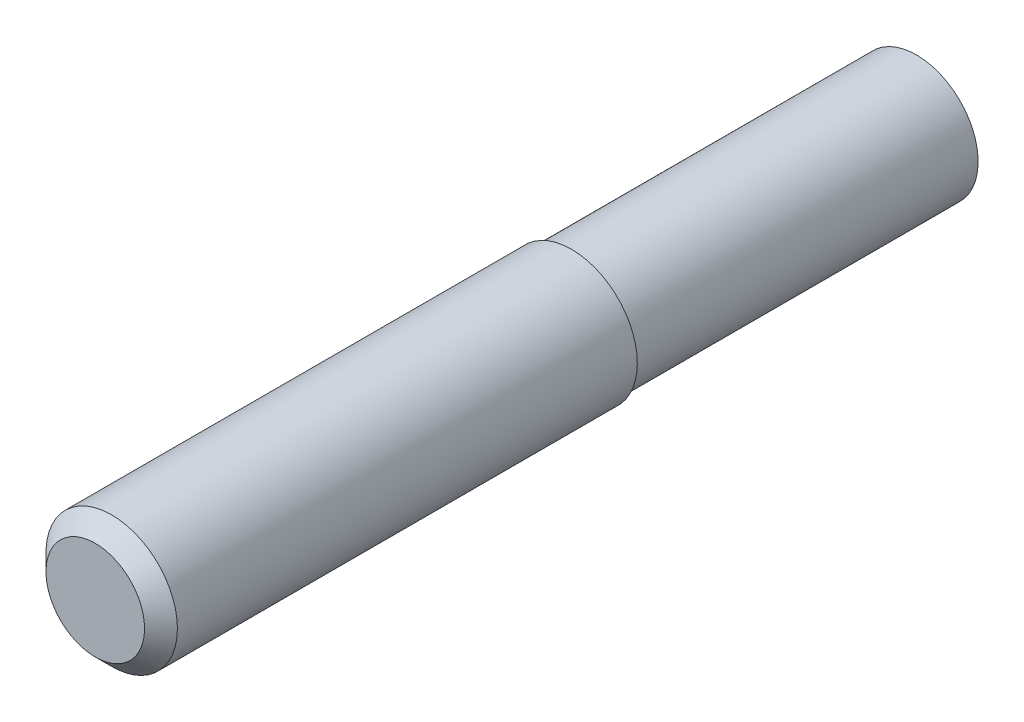
ISO-10303-21;
HEADER;
FILE_DESCRIPTION(('STEP AP214'),'2;1');
FILE_NAME('part.step','',(''),(''),'','','');
FILE_SCHEMA(('AUTOMOTIVE_DESIGN { 1 0 10303 214 1 1 1 1 }'));
ENDSEC;
DATA;
#1=APPLICATION_CONTEXT('core data for automotive mechanical design processes');
#2=APPLICATION_PROTOCOL_DEFINITION('international standard','automotive_design',2000,#1);
#3=PRODUCT_CONTEXT('',#1,'mechanical');
#4=PRODUCT('Part','Part','',(#3));
#5=PRODUCT_RELATED_PRODUCT_CATEGORY('part','',(#4));
#6=PRODUCT_DEFINITION_FORMATION('','',#4);
#7=PRODUCT_DEFINITION_CONTEXT('part definition',#1,'design');
#8=PRODUCT_DEFINITION('design','',#6,#7);
#9=PRODUCT_DEFINITION_SHAPE('','',#8);
#10=(LENGTH_UNIT() NAMED_UNIT(*) SI_UNIT(.MILLI.,.METRE.));
#11=(NAMED_UNIT(*) PLANE_ANGLE_UNIT() SI_UNIT($,.RADIAN.));
#12=(NAMED_UNIT(*) SI_UNIT($,.STERADIAN.) SOLID_ANGLE_UNIT());
#13=UNCERTAINTY_MEASURE_WITH_UNIT(LENGTH_MEASURE(1.E-05),#10,'distance_accuracy_value','');
#14=(GEOMETRIC_REPRESENTATION_CONTEXT(3) GLOBAL_UNCERTAINTY_ASSIGNED_CONTEXT((#13)) GLOBAL_UNIT_ASSIGNED_CONTEXT((#10,
#11,#12)) REPRESENTATION_CONTEXT('',''));
#15=CARTESIAN_POINT('',(0.,0.,0.));
#16=DIRECTION('',(0.,0.,1.));
#17=DIRECTION('',(1.,0.,0.));
#18=AXIS2_PLACEMENT_3D('',#15,#16,#17);
#19=CARTESIAN_POINT('',(0.,0.,32.));
#20=DIRECTION('',(0.,0.,1.));
#21=DIRECTION('',(1.,0.,0.));
#22=AXIS2_PLACEMENT_3D('',#19,#20,#21);
#23=CYLINDRICAL_SURFACE('',#22,8.);
#24=CARTESIAN_POINT('',(0.,0.,98.));
#25=DIRECTION('',(0.,0.,1.));
#26=DIRECTION('',(1.,0.,0.));
#27=AXIS2_PLACEMENT_3D('',#24,#25,#26);
#28=CIRCLE('',#27,8.);
#29=CARTESIAN_POINT('',(8.,0.,98.));
#30=VERTEX_POINT('',#29);
#31=EDGE_CURVE('E10',#30,#30,#28,.F.);
#32=ORIENTED_EDGE('',*,*,#31,.T.);
#33=EDGE_LOOP('',(#32));
#34=FACE_BOUND('',#33,.T.);
#35=CARTESIAN_POINT('',(0.,0.,42.));
#36=DIRECTION('',(0.,0.,-1.));
#37=DIRECTION('',(-1.,0.,0.));
#38=AXIS2_PLACEMENT_3D('',#35,#36,#37);
#39=CIRCLE('',#38,8.);
#40=CARTESIAN_POINT('',(-8.,0.,42.));
#41=VERTEX_POINT('',#40);
#42=EDGE_CURVE('E39',#41,#41,#39,.F.);
#43=ORIENTED_EDGE('',*,*,#42,.T.);
#44=EDGE_LOOP('',(#43));
#45=FACE_BOUND('',#44,.T.);
#46=ADVANCED_FACE('F35',(#34,#45),#23,.T.);
#47=CARTESIAN_POINT('',(0.,0.,100.));
#48=DIRECTION('',(0.,0.,1.));
#49=DIRECTION('',(1.,0.,0.));
#50=AXIS2_PLACEMENT_3D('',#47,#48,#49);
#51=PLANE('',#50);
#52=CARTESIAN_POINT('',(0.,0.,100.));
#53=DIRECTION('',(0.,0.,1.));
#54=DIRECTION('',(1.,0.,0.));
#55=AXIS2_PLACEMENT_3D('',#52,#53,#54);
#56=CIRCLE('',#55,6.00000000000001);
#57=CARTESIAN_POINT('',(6.00000000000001,0.,100.));
#58=VERTEX_POINT('',#57);
#59=EDGE_CURVE('E43',#58,#58,#56,.T.);
#60=ORIENTED_EDGE('',*,*,#59,.T.);
#61=EDGE_LOOP('',(#60));
#62=FACE_BOUND('',#61,.T.);
#63=ADVANCED_FACE('F71',(#62),#51,.T.);
#64=CARTESIAN_POINT('',(0.,0.,100.));
#65=DIRECTION('',(0.,0.,-1.));
#66=DIRECTION('',(-1.,0.,0.));
#67=AXIS2_PLACEMENT_3D('',#64,#65,#66);
#68=CONICAL_SURFACE('',#67,6.00000000000001,0.785398163397447);
#69=ORIENTED_EDGE('',*,*,#31,.F.);
#70=EDGE_LOOP('',(#69));
#71=FACE_BOUND('',#70,.T.);
#72=ORIENTED_EDGE('',*,*,#59,.F.);
#73=EDGE_LOOP('',(#72));
#74=FACE_BOUND('',#73,.T.);
#75=ADVANCED_FACE('F37',(#71,#74),#68,.T.);
#76=CARTESIAN_POINT('',(0.,0.,42.));
#77=DIRECTION('',(0.,0.,-1.));
#78=DIRECTION('',(-1.,0.,0.));
#79=AXIS2_PLACEMENT_3D('',#76,#77,#78);
#80=PLANE('',#79);
#81=ORIENTED_EDGE('',*,*,#42,.F.);
#82=EDGE_LOOP('',(#81));
#83=FACE_BOUND('',#82,.T.);
#84=CARTESIAN_POINT('',(0.,0.,42.));
#85=DIRECTION('',(0.,0.,-1.));
#86=DIRECTION('',(-1.,0.,0.));
#87=AXIS2_PLACEMENT_3D('',#84,#85,#86);
#88=CIRCLE('',#87,7.5);
#89=CARTESIAN_POINT('',(-7.5,0.,42.));
#90=VERTEX_POINT('',#89);
#91=EDGE_CURVE('E52',#90,#90,#88,.T.);
#92=ORIENTED_EDGE('',*,*,#91,.F.);
#93=EDGE_LOOP('',(#92));
#94=FACE_BOUND('',#93,.T.);
#95=ADVANCED_FACE('F60',(#83,#94),#80,.T.);
#96=CARTESIAN_POINT('',(0.,0.,42.));
#97=DIRECTION('',(0.,0.,-1.));
#98=DIRECTION('',(-1.,0.,0.));
#99=AXIS2_PLACEMENT_3D('',#96,#97,#98);
#100=CYLINDRICAL_SURFACE('',#99,7.5);
#101=ORIENTED_EDGE('',*,*,#91,.T.);
#102=EDGE_LOOP('',(#101));
#103=FACE_BOUND('',#102,.T.);
#104=CARTESIAN_POINT('',(0.,0.,0.));
#105=DIRECTION('',(0.,0.,-1.));
#106=DIRECTION('',(-1.,0.,0.));
#107=AXIS2_PLACEMENT_3D('',#104,#105,#106);
#108=CIRCLE('',#107,7.5);
#109=CARTESIAN_POINT('',(-7.5,0.,0.));
#110=VERTEX_POINT('',#109);
#111=EDGE_CURVE('E49',#110,#110,#108,.T.);
#112=ORIENTED_EDGE('',*,*,#111,.F.);
#113=EDGE_LOOP('',(#112));
#114=FACE_BOUND('',#113,.T.);
#115=ADVANCED_FACE('F63',(#103,#114),#100,.T.);
#116=CARTESIAN_POINT('',(0.,0.,0.));
#117=DIRECTION('',(0.,0.,1.));
#118=DIRECTION('',(1.,0.,0.));
#119=AXIS2_PLACEMENT_3D('',#116,#117,#118);
#120=PLANE('',#119);
#121=ORIENTED_EDGE('',*,*,#111,.T.);
#122=EDGE_LOOP('',(#121));
#123=FACE_BOUND('',#122,.T.);
#124=ADVANCED_FACE('F69',(#123),#120,.F.);
#125=CLOSED_SHELL('',(#46,#63,#75,#95,#115,#124));
#126=MANIFOLD_SOLID_BREP('B2',#125);
#127=ADVANCED_BREP_SHAPE_REPRESENTATION('',(#18,#126),#14);
#128=SHAPE_DEFINITION_REPRESENTATION(#9,#127);
ENDSEC;
END-ISO-10303-21;
